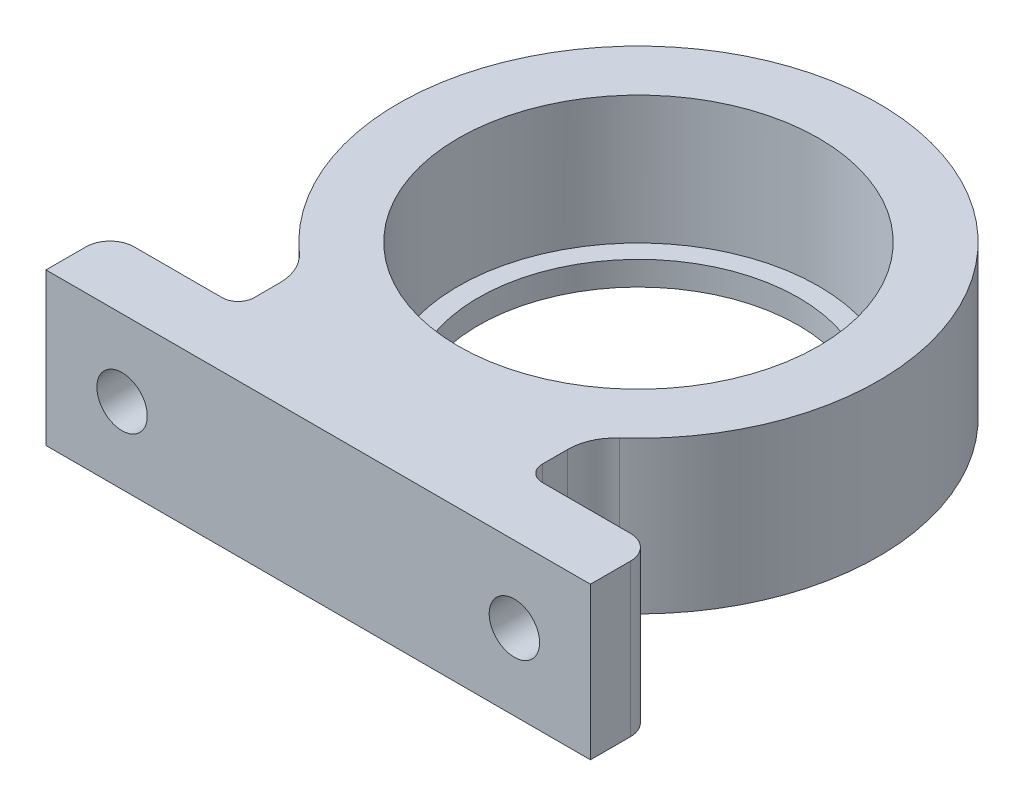
ISO-10303-21;
HEADER;
FILE_DESCRIPTION(('STEP AP214'),'2;1');
FILE_NAME('part.step','',(''),(''),'','','');
FILE_SCHEMA(('AUTOMOTIVE_DESIGN { 1 0 10303 214 1 1 1 1 }'));
ENDSEC;
DATA;
#1=APPLICATION_CONTEXT('core data for automotive mechanical design processes');
#2=APPLICATION_PROTOCOL_DEFINITION('international standard','automotive_design',2000,#1);
#3=PRODUCT_CONTEXT('',#1,'mechanical');
#4=PRODUCT('Part','Part','',(#3));
#5=PRODUCT_RELATED_PRODUCT_CATEGORY('part','',(#4));
#6=PRODUCT_DEFINITION_FORMATION('','',#4);
#7=PRODUCT_DEFINITION_CONTEXT('part definition',#1,'design');
#8=PRODUCT_DEFINITION('design','',#6,#7);
#9=PRODUCT_DEFINITION_SHAPE('','',#8);
#10=(LENGTH_UNIT() NAMED_UNIT(*) SI_UNIT(.MILLI.,.METRE.));
#11=(NAMED_UNIT(*) PLANE_ANGLE_UNIT() SI_UNIT($,.RADIAN.));
#12=(NAMED_UNIT(*) SI_UNIT($,.STERADIAN.) SOLID_ANGLE_UNIT());
#13=UNCERTAINTY_MEASURE_WITH_UNIT(LENGTH_MEASURE(1.E-05),#10,'distance_accuracy_value','');
#14=(GEOMETRIC_REPRESENTATION_CONTEXT(3) GLOBAL_UNCERTAINTY_ASSIGNED_CONTEXT((#13)) GLOBAL_UNIT_ASSIGNED_CONTEXT((#10,
#11,#12)) REPRESENTATION_CONTEXT('',''));
#15=CARTESIAN_POINT('',(0.,0.,0.));
#16=DIRECTION('',(0.,0.,1.));
#17=DIRECTION('',(1.,0.,0.));
#18=AXIS2_PLACEMENT_3D('',#15,#16,#17);
#19=CARTESIAN_POINT('',(0.,9.5,-20.422205101856));
#20=DIRECTION('',(0.,-1.,0.));
#21=DIRECTION('',(0.,0.,-1.));
#22=AXIS2_PLACEMENT_3D('',#19,#20,#21);
#23=CYLINDRICAL_SURFACE('',#22,11.25);
#24=CARTESIAN_POINT('',(0.,9.5,-20.422205101856));
#25=DIRECTION('',(0.,1.,0.));
#26=DIRECTION('',(0.,0.,1.));
#27=AXIS2_PLACEMENT_3D('',#24,#25,#26);
#28=CIRCLE('',#27,11.25);
#29=CARTESIAN_POINT('',(0.,9.5,-9.17220510185595));
#30=VERTEX_POINT('',#29);
#31=EDGE_CURVE('E166',#30,#30,#28,.T.);
#32=ORIENTED_EDGE('',*,*,#31,.T.);
#33=EDGE_LOOP('',(#32));
#34=FACE_BOUND('',#33,.T.);
#35=CARTESIAN_POINT('',(0.,1.5,-20.422205101856));
#36=DIRECTION('',(0.,-1.,0.));
#37=DIRECTION('',(0.,0.,-1.));
#38=AXIS2_PLACEMENT_3D('',#35,#36,#37);
#39=CIRCLE('',#38,11.25);
#40=CARTESIAN_POINT('',(0.,1.5,-31.672205101856));
#41=VERTEX_POINT('',#40);
#42=EDGE_CURVE('E194',#41,#41,#39,.T.);
#43=ORIENTED_EDGE('',*,*,#42,.T.);
#44=EDGE_LOOP('',(#43));
#45=FACE_BOUND('',#44,.T.);
#46=ADVANCED_FACE('F37',(#34,#45),#23,.F.);
#47=CARTESIAN_POINT('',(0.,9.5,-4.42220510185595));
#48=DIRECTION('',(0.,0.,-1.));
#49=DIRECTION('',(-1.,0.,0.));
#50=AXIS2_PLACEMENT_3D('',#47,#48,#49);
#51=PLANE('',#50);
#52=CARTESIAN_POINT('',(-12.25,4.75,-4.42220510185595));
#53=DIRECTION('',(0.,0.,-1.));
#54=DIRECTION('',(-1.,0.,0.));
#55=AXIS2_PLACEMENT_3D('',#52,#53,#54);
#56=CIRCLE('',#55,1.575);
#57=CARTESIAN_POINT('',(-13.825,4.75,-4.42220510185595));
#58=VERTEX_POINT('',#57);
#59=EDGE_CURVE('E491',#58,#58,#56,.T.);
#60=ORIENTED_EDGE('',*,*,#59,.F.);
#61=EDGE_LOOP('',(#60));
#62=FACE_BOUND('',#61,.T.);
#63=DIRECTION('',(1.,0.,0.));
#64=VECTOR('',#63,1.);
#65=CARTESIAN_POINT('',(0.,9.5,-4.42220510185595));
#66=LINE('',#65,#64);
#67=CARTESIAN_POINT('',(-15.5,9.5,-4.42220510185595));
#68=VERTEX_POINT('',#67);
#69=CARTESIAN_POINT('',(-10.,9.5,-4.42220510185595));
#70=VERTEX_POINT('',#69);
#71=EDGE_CURVE('E144',#68,#70,#66,.T.);
#72=ORIENTED_EDGE('',*,*,#71,.T.);
#73=DIRECTION('',(0.,-1.,0.));
#74=VECTOR('',#73,1.);
#75=CARTESIAN_POINT('',(-10.,0.,-4.42220510185595));
#76=LINE('',#75,#74);
#77=CARTESIAN_POINT('',(-10.,0.,-4.42220510185595));
#78=VERTEX_POINT('',#77);
#79=EDGE_CURVE('E233',#70,#78,#76,.T.);
#80=ORIENTED_EDGE('',*,*,#79,.T.);
#81=DIRECTION('',(1.,0.,0.));
#82=VECTOR('',#81,1.);
#83=CARTESIAN_POINT('',(0.,0.,-4.42220510185595));
#84=LINE('',#83,#82);
#85=CARTESIAN_POINT('',(-15.5,0.,-4.42220510185595));
#86=VERTEX_POINT('',#85);
#87=EDGE_CURVE('E147',#86,#78,#84,.T.);
#88=ORIENTED_EDGE('',*,*,#87,.F.);
#89=DIRECTION('',(0.,-1.,0.));
#90=VECTOR('',#89,1.);
#91=CARTESIAN_POINT('',(-15.5,9.5,-4.42220510185595));
#92=LINE('',#91,#90);
#93=EDGE_CURVE('E139',#68,#86,#92,.T.);
#94=ORIENTED_EDGE('',*,*,#93,.F.);
#95=EDGE_LOOP('',(#72,#80,#88,#94));
#96=FACE_BOUND('',#95,.T.);
#97=ADVANCED_FACE('F141',(#62,#96),#51,.T.);
#98=CARTESIAN_POINT('',(-15.5,9.5,-2.92220510185595));
#99=DIRECTION('',(0.,-1.,0.));
#100=DIRECTION('',(0.,0.,-1.));
#101=AXIS2_PLACEMENT_3D('',#98,#99,#100);
#102=CYLINDRICAL_SURFACE('',#101,1.5);
#103=CARTESIAN_POINT('',(-15.5,0.,-2.92220510185595));
#104=DIRECTION('',(0.,1.,0.));
#105=DIRECTION('',(0.,0.,1.));
#106=AXIS2_PLACEMENT_3D('',#103,#104,#105);
#107=CIRCLE('',#106,1.5);
#108=CARTESIAN_POINT('',(-17.,0.,-2.92220510185595));
#109=VERTEX_POINT('',#108);
#110=EDGE_CURVE('E193',#86,#109,#107,.T.);
#111=ORIENTED_EDGE('',*,*,#110,.T.);
#112=DIRECTION('',(0.,-1.,0.));
#113=VECTOR('',#112,1.);
#114=CARTESIAN_POINT('',(-17.,9.5,-2.92220510185595));
#115=LINE('',#114,#113);
#116=CARTESIAN_POINT('',(-17.,9.5,-2.92220510185595));
#117=VERTEX_POINT('',#116);
#118=EDGE_CURVE('E152',#117,#109,#115,.T.);
#119=ORIENTED_EDGE('',*,*,#118,.F.);
#120=CARTESIAN_POINT('',(-15.5,9.5,-2.92220510185595));
#121=DIRECTION('',(0.,1.,0.));
#122=DIRECTION('',(0.,0.,1.));
#123=AXIS2_PLACEMENT_3D('',#120,#121,#122);
#124=CIRCLE('',#123,1.5);
#125=EDGE_CURVE('E156',#68,#117,#124,.T.);
#126=ORIENTED_EDGE('',*,*,#125,.F.);
#127=ORIENTED_EDGE('',*,*,#93,.T.);
#128=EDGE_LOOP('',(#111,#119,#126,#127));
#129=FACE_BOUND('',#128,.T.);
#130=ADVANCED_FACE('F157',(#129),#102,.T.);
#131=CARTESIAN_POINT('',(-17.,9.5,0.));
#132=DIRECTION('',(1.,0.,0.));
#133=DIRECTION('',(0.,0.,-1.));
#134=AXIS2_PLACEMENT_3D('',#131,#132,#133);
#135=PLANE('',#134);
#136=DIRECTION('',(0.,0.,1.));
#137=VECTOR('',#136,1.);
#138=CARTESIAN_POINT('',(-17.,0.,0.));
#139=LINE('',#138,#137);
#140=CARTESIAN_POINT('',(-17.,0.,-0.422205101855954));
#141=VERTEX_POINT('',#140);
#142=EDGE_CURVE('E196',#109,#141,#139,.T.);
#143=ORIENTED_EDGE('',*,*,#142,.T.);
#144=DIRECTION('',(0.,-1.,0.));
#145=VECTOR('',#144,1.);
#146=CARTESIAN_POINT('',(-17.,9.5,-0.422205101855954));
#147=LINE('',#146,#145);
#148=CARTESIAN_POINT('',(-17.,9.5,-0.422205101855954));
#149=VERTEX_POINT('',#148);
#150=EDGE_CURVE('E223',#149,#141,#147,.T.);
#151=ORIENTED_EDGE('',*,*,#150,.F.);
#152=DIRECTION('',(0.,0.,1.));
#153=VECTOR('',#152,1.);
#154=CARTESIAN_POINT('',(-17.,9.5,0.));
#155=LINE('',#154,#153);
#156=EDGE_CURVE('E160',#117,#149,#155,.T.);
#157=ORIENTED_EDGE('',*,*,#156,.F.);
#158=ORIENTED_EDGE('',*,*,#118,.T.);
#159=EDGE_LOOP('',(#143,#151,#157,#158));
#160=FACE_BOUND('',#159,.T.);
#161=ADVANCED_FACE('F270',(#160),#135,.F.);
#162=CARTESIAN_POINT('',(0.,9.5,-0.422205101855954));
#163=DIRECTION('',(0.,0.,-1.));
#164=DIRECTION('',(-1.,0.,0.));
#165=AXIS2_PLACEMENT_3D('',#162,#163,#164);
#166=PLANE('',#165);
#167=CARTESIAN_POINT('',(12.25,4.75,-0.422205101855949));
#168=DIRECTION('',(0.,0.,-1.));
#169=DIRECTION('',(-1.,0.,0.));
#170=AXIS2_PLACEMENT_3D('',#167,#168,#169);
#171=CIRCLE('',#170,1.575);
#172=CARTESIAN_POINT('',(10.675,4.75,-0.422205101855949));
#173=VERTEX_POINT('',#172);
#174=EDGE_CURVE('E486',#173,#173,#171,.T.);
#175=ORIENTED_EDGE('',*,*,#174,.T.);
#176=EDGE_LOOP('',(#175));
#177=FACE_BOUND('',#176,.T.);
#178=CARTESIAN_POINT('',(-12.25,4.75,-0.422205101855949));
#179=DIRECTION('',(0.,0.,-1.));
#180=DIRECTION('',(-1.,0.,0.));
#181=AXIS2_PLACEMENT_3D('',#178,#179,#180);
#182=CIRCLE('',#181,1.575);
#183=CARTESIAN_POINT('',(-13.825,4.75,-0.422205101855949));
#184=VERTEX_POINT('',#183);
#185=EDGE_CURVE('E489',#184,#184,#182,.T.);
#186=ORIENTED_EDGE('',*,*,#185,.T.);
#187=EDGE_LOOP('',(#186));
#188=FACE_BOUND('',#187,.T.);
#189=DIRECTION('',(1.,0.,0.));
#190=VECTOR('',#189,1.);
#191=CARTESIAN_POINT('',(0.,0.,-0.422205101855954));
#192=LINE('',#191,#190);
#193=CARTESIAN_POINT('',(17.,0.,-0.422205101855954));
#194=VERTEX_POINT('',#193);
#195=EDGE_CURVE('E199',#141,#194,#192,.T.);
#196=ORIENTED_EDGE('',*,*,#195,.T.);
#197=DIRECTION('',(0.,-1.,0.));
#198=VECTOR('',#197,1.);
#199=CARTESIAN_POINT('',(17.,9.5,-0.422205101855954));
#200=LINE('',#199,#198);
#201=CARTESIAN_POINT('',(17.,9.5,-0.422205101855954));
#202=VERTEX_POINT('',#201);
#203=EDGE_CURVE('E221',#202,#194,#200,.T.);
#204=ORIENTED_EDGE('',*,*,#203,.F.);
#205=DIRECTION('',(1.,0.,0.));
#206=VECTOR('',#205,1.);
#207=CARTESIAN_POINT('',(0.,9.5,-0.422205101855954));
#208=LINE('',#207,#206);
#209=EDGE_CURVE('E174',#149,#202,#208,.T.);
#210=ORIENTED_EDGE('',*,*,#209,.F.);
#211=ORIENTED_EDGE('',*,*,#150,.T.);
#212=EDGE_LOOP('',(#196,#204,#210,#211));
#213=FACE_BOUND('',#212,.T.);
#214=ADVANCED_FACE('F275',(#177,#188,#213),#166,.F.);
#215=CARTESIAN_POINT('',(17.,9.5,0.));
#216=DIRECTION('',(1.,0.,0.));
#217=DIRECTION('',(0.,0.,-1.));
#218=AXIS2_PLACEMENT_3D('',#215,#216,#217);
#219=PLANE('',#218);
#220=DIRECTION('',(0.,0.,1.));
#221=VECTOR('',#220,1.);
#222=CARTESIAN_POINT('',(17.,0.,0.));
#223=LINE('',#222,#221);
#224=CARTESIAN_POINT('',(17.,0.,-2.92220510185595));
#225=VERTEX_POINT('',#224);
#226=EDGE_CURVE('E202',#225,#194,#223,.T.);
#227=ORIENTED_EDGE('',*,*,#226,.F.);
#228=DIRECTION('',(0.,-1.,0.));
#229=VECTOR('',#228,1.);
#230=CARTESIAN_POINT('',(17.,9.5,-2.92220510185595));
#231=LINE('',#230,#229);
#232=CARTESIAN_POINT('',(17.,9.5,-2.92220510185595));
#233=VERTEX_POINT('',#232);
#234=EDGE_CURVE('E219',#233,#225,#231,.T.);
#235=ORIENTED_EDGE('',*,*,#234,.F.);
#236=DIRECTION('',(0.,0.,1.));
#237=VECTOR('',#236,1.);
#238=CARTESIAN_POINT('',(17.,9.5,0.));
#239=LINE('',#238,#237);
#240=EDGE_CURVE('E176',#233,#202,#239,.T.);
#241=ORIENTED_EDGE('',*,*,#240,.T.);
#242=ORIENTED_EDGE('',*,*,#203,.T.);
#243=EDGE_LOOP('',(#227,#235,#241,#242));
#244=FACE_BOUND('',#243,.T.);
#245=ADVANCED_FACE('F278',(#244),#219,.T.);
#246=CARTESIAN_POINT('',(15.5,9.5,-2.92220510185595));
#247=DIRECTION('',(0.,-1.,0.));
#248=DIRECTION('',(0.,0.,-1.));
#249=AXIS2_PLACEMENT_3D('',#246,#247,#248);
#250=CYLINDRICAL_SURFACE('',#249,1.5);
#251=CARTESIAN_POINT('',(15.5,0.,-2.92220510185595));
#252=DIRECTION('',(0.,1.,0.));
#253=DIRECTION('',(0.,0.,1.));
#254=AXIS2_PLACEMENT_3D('',#251,#252,#253);
#255=CIRCLE('',#254,1.5);
#256=CARTESIAN_POINT('',(15.5,0.,-4.42220510185595));
#257=VERTEX_POINT('',#256);
#258=EDGE_CURVE('E205',#257,#225,#255,.F.);
#259=ORIENTED_EDGE('',*,*,#258,.F.);
#260=DIRECTION('',(0.,-1.,0.));
#261=VECTOR('',#260,1.);
#262=CARTESIAN_POINT('',(15.5,9.5,-4.42220510185595));
#263=LINE('',#262,#261);
#264=CARTESIAN_POINT('',(15.5,9.5,-4.42220510185595));
#265=VERTEX_POINT('',#264);
#266=EDGE_CURVE('E191',#265,#257,#263,.T.);
#267=ORIENTED_EDGE('',*,*,#266,.F.);
#268=CARTESIAN_POINT('',(15.5,9.5,-2.92220510185595));
#269=DIRECTION('',(0.,1.,0.));
#270=DIRECTION('',(0.,0.,1.));
#271=AXIS2_PLACEMENT_3D('',#268,#269,#270);
#272=CIRCLE('',#271,1.5);
#273=EDGE_CURVE('E179',#265,#233,#272,.F.);
#274=ORIENTED_EDGE('',*,*,#273,.T.);
#275=ORIENTED_EDGE('',*,*,#234,.T.);
#276=EDGE_LOOP('',(#259,#267,#274,#275));
#277=FACE_BOUND('',#276,.T.);
#278=ADVANCED_FACE('F281',(#277),#250,.T.);
#279=CARTESIAN_POINT('',(0.,9.5,-4.42220510185595));
#280=DIRECTION('',(0.,0.,-1.));
#281=DIRECTION('',(-1.,0.,0.));
#282=AXIS2_PLACEMENT_3D('',#279,#280,#281);
#283=PLANE('',#282);
#284=CARTESIAN_POINT('',(12.25,4.75,-4.42220510185595));
#285=DIRECTION('',(0.,0.,-1.));
#286=DIRECTION('',(-1.,0.,0.));
#287=AXIS2_PLACEMENT_3D('',#284,#285,#286);
#288=CIRCLE('',#287,1.575);
#289=CARTESIAN_POINT('',(10.675,4.75,-4.42220510185595));
#290=VERTEX_POINT('',#289);
#291=EDGE_CURVE('E499',#290,#290,#288,.T.);
#292=ORIENTED_EDGE('',*,*,#291,.F.);
#293=EDGE_LOOP('',(#292));
#294=FACE_BOUND('',#293,.T.);
#295=DIRECTION('',(1.,0.,0.));
#296=VECTOR('',#295,1.);
#297=CARTESIAN_POINT('',(0.,0.,-4.42220510185595));
#298=LINE('',#297,#296);
#299=CARTESIAN_POINT('',(9.99999999999999,0.,-4.42220510185595));
#300=VERTEX_POINT('',#299);
#301=EDGE_CURVE('E208',#300,#257,#298,.T.);
#302=ORIENTED_EDGE('',*,*,#301,.F.);
#303=DIRECTION('',(0.,-1.,0.));
#304=VECTOR('',#303,1.);
#305=CARTESIAN_POINT('',(9.99999999999999,9.5,-4.42220510185595));
#306=LINE('',#305,#304);
#307=CARTESIAN_POINT('',(9.99999999999999,9.5,-4.42220510185595));
#308=VERTEX_POINT('',#307);
#309=EDGE_CURVE('E231',#300,#308,#306,.F.);
#310=ORIENTED_EDGE('',*,*,#309,.T.);
#311=DIRECTION('',(1.,0.,0.));
#312=VECTOR('',#311,1.);
#313=CARTESIAN_POINT('',(0.,9.5,-4.42220510185595));
#314=LINE('',#313,#312);
#315=EDGE_CURVE('E182',#308,#265,#314,.T.);
#316=ORIENTED_EDGE('',*,*,#315,.T.);
#317=ORIENTED_EDGE('',*,*,#266,.T.);
#318=EDGE_LOOP('',(#302,#310,#316,#317));
#319=FACE_BOUND('',#318,.T.);
#320=ADVANCED_FACE('F350',(#294,#319),#283,.T.);
#321=CARTESIAN_POINT('',(8.99999999999999,9.5,0.));
#322=DIRECTION('',(-1.,0.,0.));
#323=DIRECTION('',(0.,0.,1.));
#324=AXIS2_PLACEMENT_3D('',#321,#322,#323);
#325=PLANE('',#324);
#326=DIRECTION('',(0.,0.,-1.));
#327=VECTOR('',#326,1.);
#328=CARTESIAN_POINT('',(8.99999999999999,9.5,0.));
#329=LINE('',#328,#327);
#330=CARTESIAN_POINT('',(8.99999999999999,9.5,-5.42220510185595));
#331=VERTEX_POINT('',#330);
#332=CARTESIAN_POINT('',(8.99999999999999,9.5,-7.00579723685721));
#333=VERTEX_POINT('',#332);
#334=EDGE_CURVE('E184',#331,#333,#329,.T.);
#335=ORIENTED_EDGE('',*,*,#334,.F.);
#336=DIRECTION('',(0.,-1.,0.));
#337=VECTOR('',#336,1.);
#338=CARTESIAN_POINT('',(8.99999999999999,9.5,-5.42220510185595));
#339=LINE('',#338,#337);
#340=CARTESIAN_POINT('',(8.99999999999999,0.,-5.42220510185595));
#341=VERTEX_POINT('',#340);
#342=EDGE_CURVE('E228',#331,#341,#339,.T.);
#343=ORIENTED_EDGE('',*,*,#342,.T.);
#344=DIRECTION('',(0.,0.,-1.));
#345=VECTOR('',#344,1.);
#346=CARTESIAN_POINT('',(8.99999999999999,0.,0.));
#347=LINE('',#346,#345);
#348=CARTESIAN_POINT('',(8.99999999999999,0.,-7.00579723685721));
#349=VERTEX_POINT('',#348);
#350=EDGE_CURVE('E210',#341,#349,#347,.T.);
#351=ORIENTED_EDGE('',*,*,#350,.T.);
#352=DIRECTION('',(0.,1.,0.));
#353=VECTOR('',#352,1.);
#354=CARTESIAN_POINT('',(8.99999999999999,9.5,-7.00579723685721));
#355=LINE('',#354,#353);
#356=EDGE_CURVE('E151',#349,#333,#355,.T.);
#357=ORIENTED_EDGE('',*,*,#356,.T.);
#358=EDGE_LOOP('',(#335,#343,#351,#357));
#359=FACE_BOUND('',#358,.T.);
#360=ADVANCED_FACE('F293',(#359),#325,.F.);
#361=CARTESIAN_POINT('',(0.,9.5,-20.422205101856));
#362=DIRECTION('',(0.,-1.,0.));
#363=DIRECTION('',(0.,0.,-1.));
#364=AXIS2_PLACEMENT_3D('',#361,#362,#363);
#365=CYLINDRICAL_SURFACE('',#364,15.);
#366=CARTESIAN_POINT('',(0.,9.5,-20.422205101856));
#367=DIRECTION('',(0.,1.,0.));
#368=DIRECTION('',(0.,0.,1.));
#369=AXIS2_PLACEMENT_3D('',#366,#367,#368);
#370=CIRCLE('',#369,15.);
#371=CARTESIAN_POINT('',(9.99999999999999,9.5,-9.241865214357));
#372=VERTEX_POINT('',#371);
#373=CARTESIAN_POINT('',(-10.,9.5,-9.241865214357));
#374=VERTEX_POINT('',#373);
#375=EDGE_CURVE('E186',#372,#374,#370,.T.);
#376=ORIENTED_EDGE('',*,*,#375,.F.);
#377=DIRECTION('',(0.,-1.,0.));
#378=VECTOR('',#377,1.);
#379=CARTESIAN_POINT('',(9.99999999999999,9.5,-9.241865214357));
#380=LINE('',#379,#378);
#381=CARTESIAN_POINT('',(9.99999999999999,0.,-9.241865214357));
#382=VERTEX_POINT('',#381);
#383=EDGE_CURVE('E241',#372,#382,#380,.T.);
#384=ORIENTED_EDGE('',*,*,#383,.T.);
#385=CARTESIAN_POINT('',(0.,0.,-20.422205101856));
#386=DIRECTION('',(0.,1.,0.));
#387=DIRECTION('',(0.,0.,1.));
#388=AXIS2_PLACEMENT_3D('',#385,#386,#387);
#389=CIRCLE('',#388,15.);
#390=CARTESIAN_POINT('',(-10.,0.,-9.241865214357));
#391=VERTEX_POINT('',#390);
#392=EDGE_CURVE('E213',#382,#391,#389,.T.);
#393=ORIENTED_EDGE('',*,*,#392,.T.);
#394=DIRECTION('',(0.,-1.,0.));
#395=VECTOR('',#394,1.);
#396=CARTESIAN_POINT('',(-10.,9.5,-9.241865214357));
#397=LINE('',#396,#395);
#398=EDGE_CURVE('E52',#391,#374,#397,.F.);
#399=ORIENTED_EDGE('',*,*,#398,.T.);
#400=EDGE_LOOP('',(#376,#384,#393,#399));
#401=FACE_BOUND('',#400,.T.);
#402=ADVANCED_FACE('F260',(#401),#365,.T.);
#403=CARTESIAN_POINT('',(-9.,9.5,0.));
#404=DIRECTION('',(-1.,0.,0.));
#405=DIRECTION('',(0.,0.,1.));
#406=AXIS2_PLACEMENT_3D('',#403,#404,#405);
#407=PLANE('',#406);
#408=DIRECTION('',(0.,0.,-1.));
#409=VECTOR('',#408,1.);
#410=CARTESIAN_POINT('',(-9.,0.,0.));
#411=LINE('',#410,#409);
#412=CARTESIAN_POINT('',(-9.,0.,-5.42220510185595));
#413=VERTEX_POINT('',#412);
#414=CARTESIAN_POINT('',(-9.,0.,-7.00579723685721));
#415=VERTEX_POINT('',#414);
#416=EDGE_CURVE('E169',#413,#415,#411,.T.);
#417=ORIENTED_EDGE('',*,*,#416,.F.);
#418=DIRECTION('',(0.,-1.,0.));
#419=VECTOR('',#418,1.);
#420=CARTESIAN_POINT('',(-9.,9.5,-5.42220510185595));
#421=LINE('',#420,#419);
#422=CARTESIAN_POINT('',(-9.,9.5,-5.42220510185595));
#423=VERTEX_POINT('',#422);
#424=EDGE_CURVE('E238',#413,#423,#421,.F.);
#425=ORIENTED_EDGE('',*,*,#424,.T.);
#426=DIRECTION('',(0.,0.,-1.));
#427=VECTOR('',#426,1.);
#428=CARTESIAN_POINT('',(-9.,9.5,0.));
#429=LINE('',#428,#427);
#430=CARTESIAN_POINT('',(-9.,9.5,-7.00579723685721));
#431=VERTEX_POINT('',#430);
#432=EDGE_CURVE('E188',#423,#431,#429,.T.);
#433=ORIENTED_EDGE('',*,*,#432,.T.);
#434=DIRECTION('',(0.,-1.,0.));
#435=VECTOR('',#434,1.);
#436=CARTESIAN_POINT('',(-9.,9.5,-7.00579723685721));
#437=LINE('',#436,#435);
#438=EDGE_CURVE('E235',#431,#415,#437,.T.);
#439=ORIENTED_EDGE('',*,*,#438,.T.);
#440=EDGE_LOOP('',(#417,#425,#433,#439));
#441=FACE_BOUND('',#440,.T.);
#442=ADVANCED_FACE('F264',(#441),#407,.T.);
#443=CARTESIAN_POINT('',(0.,9.5,0.));
#444=DIRECTION('',(0.,1.,0.));
#445=DIRECTION('',(0.,0.,1.));
#446=AXIS2_PLACEMENT_3D('',#443,#444,#445);
#447=PLANE('',#446);
#448=ORIENTED_EDGE('',*,*,#31,.F.);
#449=EDGE_LOOP('',(#448));
#450=FACE_BOUND('',#449,.T.);
#451=ORIENTED_EDGE('',*,*,#71,.F.);
#452=ORIENTED_EDGE('',*,*,#125,.T.);
#453=ORIENTED_EDGE('',*,*,#156,.T.);
#454=ORIENTED_EDGE('',*,*,#209,.T.);
#455=ORIENTED_EDGE('',*,*,#240,.F.);
#456=ORIENTED_EDGE('',*,*,#273,.F.);
#457=ORIENTED_EDGE('',*,*,#315,.F.);
#458=CARTESIAN_POINT('',(9.99999999999999,9.5,-5.42220510185595));
#459=DIRECTION('',(0.,1.,0.));
#460=DIRECTION('',(0.,0.,1.));
#461=AXIS2_PLACEMENT_3D('',#458,#459,#460);
#462=CIRCLE('',#461,1.);
#463=EDGE_CURVE('E246',#308,#331,#462,.F.);
#464=ORIENTED_EDGE('',*,*,#463,.T.);
#465=ORIENTED_EDGE('',*,*,#334,.T.);
#466=CARTESIAN_POINT('',(12.,9.5,-7.00579723685721));
#467=DIRECTION('',(0.,1.,0.));
#468=DIRECTION('',(0.,0.,1.));
#469=AXIS2_PLACEMENT_3D('',#466,#467,#468);
#470=CIRCLE('',#469,3.);
#471=EDGE_CURVE('E59',#333,#372,#470,.F.);
#472=ORIENTED_EDGE('',*,*,#471,.T.);
#473=ORIENTED_EDGE('',*,*,#375,.T.);
#474=CARTESIAN_POINT('',(-12.,9.5,-7.00579723685721));
#475=DIRECTION('',(0.,1.,0.));
#476=DIRECTION('',(0.,0.,1.));
#477=AXIS2_PLACEMENT_3D('',#474,#475,#476);
#478=CIRCLE('',#477,3.);
#479=EDGE_CURVE('E12',#374,#431,#478,.F.);
#480=ORIENTED_EDGE('',*,*,#479,.T.);
#481=ORIENTED_EDGE('',*,*,#432,.F.);
#482=CARTESIAN_POINT('',(-10.,9.5,-5.42220510185595));
#483=DIRECTION('',(0.,1.,0.));
#484=DIRECTION('',(0.,0.,1.));
#485=AXIS2_PLACEMENT_3D('',#482,#483,#484);
#486=CIRCLE('',#485,1.);
#487=EDGE_CURVE('E165',#423,#70,#486,.F.);
#488=ORIENTED_EDGE('',*,*,#487,.T.);
#489=EDGE_LOOP('',(#451,#452,#453,#454,#455,#456,#457,#464,#465,#472,#473,#480,#481,#488));
#490=FACE_BOUND('',#489,.T.);
#491=ADVANCED_FACE('F162',(#450,#490),#447,.T.);
#492=CARTESIAN_POINT('',(0.,0.,0.));
#493=DIRECTION('',(0.,1.,0.));
#494=DIRECTION('',(0.,0.,1.));
#495=AXIS2_PLACEMENT_3D('',#492,#493,#494);
#496=PLANE('',#495);
#497=ORIENTED_EDGE('',*,*,#87,.T.);
#498=CARTESIAN_POINT('',(-10.,0.,-5.42220510185595));
#499=DIRECTION('',(0.,1.,0.));
#500=DIRECTION('',(0.,0.,1.));
#501=AXIS2_PLACEMENT_3D('',#498,#499,#500);
#502=CIRCLE('',#501,1.);
#503=EDGE_CURVE('E248',#78,#413,#502,.T.);
#504=ORIENTED_EDGE('',*,*,#503,.T.);
#505=ORIENTED_EDGE('',*,*,#416,.T.);
#506=CARTESIAN_POINT('',(-12.,0.,-7.00579723685721));
#507=DIRECTION('',(0.,1.,0.));
#508=DIRECTION('',(0.,0.,1.));
#509=AXIS2_PLACEMENT_3D('',#506,#507,#508);
#510=CIRCLE('',#509,3.);
#511=EDGE_CURVE('E45',#415,#391,#510,.T.);
#512=ORIENTED_EDGE('',*,*,#511,.T.);
#513=ORIENTED_EDGE('',*,*,#392,.F.);
#514=CARTESIAN_POINT('',(12.,0.,-7.00579723685721));
#515=DIRECTION('',(0.,1.,0.));
#516=DIRECTION('',(0.,0.,1.));
#517=AXIS2_PLACEMENT_3D('',#514,#515,#516);
#518=CIRCLE('',#517,3.);
#519=EDGE_CURVE('E251',#382,#349,#518,.T.);
#520=ORIENTED_EDGE('',*,*,#519,.T.);
#521=ORIENTED_EDGE('',*,*,#350,.F.);
#522=CARTESIAN_POINT('',(9.99999999999999,0.,-5.42220510185595));
#523=DIRECTION('',(0.,1.,0.));
#524=DIRECTION('',(0.,0.,1.));
#525=AXIS2_PLACEMENT_3D('',#522,#523,#524);
#526=CIRCLE('',#525,1.);
#527=EDGE_CURVE('E244',#341,#300,#526,.T.);
#528=ORIENTED_EDGE('',*,*,#527,.T.);
#529=ORIENTED_EDGE('',*,*,#301,.T.);
#530=ORIENTED_EDGE('',*,*,#258,.T.);
#531=ORIENTED_EDGE('',*,*,#226,.T.);
#532=ORIENTED_EDGE('',*,*,#195,.F.);
#533=ORIENTED_EDGE('',*,*,#142,.F.);
#534=ORIENTED_EDGE('',*,*,#110,.F.);
#535=EDGE_LOOP('',(#497,#504,#505,#512,#513,#520,#521,#528,#529,#530,#531,#532,#533,#534));
#536=FACE_BOUND('',#535,.T.);
#537=CARTESIAN_POINT('',(0.,0.,-20.422205101856));
#538=DIRECTION('',(0.,-1.,0.));
#539=DIRECTION('',(0.,0.,-1.));
#540=AXIS2_PLACEMENT_3D('',#537,#538,#539);
#541=CIRCLE('',#540,10.);
#542=CARTESIAN_POINT('',(0.,0.,-30.422205101856));
#543=VERTEX_POINT('',#542);
#544=EDGE_CURVE('E490',#543,#543,#541,.T.);
#545=ORIENTED_EDGE('',*,*,#544,.F.);
#546=EDGE_LOOP('',(#545));
#547=FACE_BOUND('',#546,.T.);
#548=ADVANCED_FACE('F255',(#536,#547),#496,.F.);
#549=CARTESIAN_POINT('',(0.,1.5,-20.422205101856));
#550=DIRECTION('',(0.,-1.,0.));
#551=DIRECTION('',(0.,0.,-1.));
#552=AXIS2_PLACEMENT_3D('',#549,#550,#551);
#553=PLANE('',#552);
#554=CARTESIAN_POINT('',(0.,1.5,-20.422205101856));
#555=DIRECTION('',(0.,-1.,0.));
#556=DIRECTION('',(0.,0.,-1.));
#557=AXIS2_PLACEMENT_3D('',#554,#555,#556);
#558=CIRCLE('',#557,10.);
#559=CARTESIAN_POINT('',(0.,1.5,-30.422205101856));
#560=VERTEX_POINT('',#559);
#561=EDGE_CURVE('E494',#560,#560,#558,.T.);
#562=ORIENTED_EDGE('',*,*,#561,.T.);
#563=EDGE_LOOP('',(#562));
#564=FACE_BOUND('',#563,.T.);
#565=ORIENTED_EDGE('',*,*,#42,.F.);
#566=EDGE_LOOP('',(#565));
#567=FACE_BOUND('',#566,.T.);
#568=ADVANCED_FACE('F334',(#564,#567),#553,.F.);
#569=CARTESIAN_POINT('',(0.,1.5,-20.422205101856));
#570=DIRECTION('',(0.,-1.,0.));
#571=DIRECTION('',(0.,0.,-1.));
#572=AXIS2_PLACEMENT_3D('',#569,#570,#571);
#573=CYLINDRICAL_SURFACE('',#572,10.);
#574=ORIENTED_EDGE('',*,*,#561,.F.);
#575=EDGE_LOOP('',(#574));
#576=FACE_BOUND('',#575,.T.);
#577=ORIENTED_EDGE('',*,*,#544,.T.);
#578=EDGE_LOOP('',(#577));
#579=FACE_BOUND('',#578,.T.);
#580=ADVANCED_FACE('F326',(#576,#579),#573,.F.);
#581=CARTESIAN_POINT('',(-12.25,4.75,-0.422205101855949));
#582=DIRECTION('',(0.,0.,-1.));
#583=DIRECTION('',(-1.,0.,0.));
#584=AXIS2_PLACEMENT_3D('',#581,#582,#583);
#585=CYLINDRICAL_SURFACE('',#584,1.575);
#586=ORIENTED_EDGE('',*,*,#185,.F.);
#587=EDGE_LOOP('',(#586));
#588=FACE_BOUND('',#587,.T.);
#589=ORIENTED_EDGE('',*,*,#59,.T.);
#590=EDGE_LOOP('',(#589));
#591=FACE_BOUND('',#590,.T.);
#592=ADVANCED_FACE('F320',(#588,#591),#585,.F.);
#593=CARTESIAN_POINT('',(12.25,4.75,-0.422205101855949));
#594=DIRECTION('',(0.,0.,-1.));
#595=DIRECTION('',(-1.,0.,0.));
#596=AXIS2_PLACEMENT_3D('',#593,#594,#595);
#597=CYLINDRICAL_SURFACE('',#596,1.575);
#598=ORIENTED_EDGE('',*,*,#174,.F.);
#599=EDGE_LOOP('',(#598));
#600=FACE_BOUND('',#599,.T.);
#601=ORIENTED_EDGE('',*,*,#291,.T.);
#602=EDGE_LOOP('',(#601));
#603=FACE_BOUND('',#602,.T.);
#604=ADVANCED_FACE('F316',(#600,#603),#597,.F.);
#605=CARTESIAN_POINT('',(9.99999999999999,9.5,-5.42220510185595));
#606=DIRECTION('',(0.,-1.,0.));
#607=DIRECTION('',(0.,0.,-1.));
#608=AXIS2_PLACEMENT_3D('',#605,#606,#607);
#609=CYLINDRICAL_SURFACE('',#608,1.);
#610=ORIENTED_EDGE('',*,*,#463,.F.);
#611=ORIENTED_EDGE('',*,*,#309,.F.);
#612=ORIENTED_EDGE('',*,*,#527,.F.);
#613=ORIENTED_EDGE('',*,*,#342,.F.);
#614=EDGE_LOOP('',(#610,#611,#612,#613));
#615=FACE_BOUND('',#614,.T.);
#616=ADVANCED_FACE('F290',(#615),#609,.F.);
#617=CARTESIAN_POINT('',(-10.,9.5,-5.42220510185595));
#618=DIRECTION('',(0.,1.,0.));
#619=DIRECTION('',(0.,0.,1.));
#620=AXIS2_PLACEMENT_3D('',#617,#618,#619);
#621=CYLINDRICAL_SURFACE('',#620,1.);
#622=ORIENTED_EDGE('',*,*,#487,.F.);
#623=ORIENTED_EDGE('',*,*,#424,.F.);
#624=ORIENTED_EDGE('',*,*,#503,.F.);
#625=ORIENTED_EDGE('',*,*,#79,.F.);
#626=EDGE_LOOP('',(#622,#623,#624,#625));
#627=FACE_BOUND('',#626,.T.);
#628=ADVANCED_FACE('F267',(#627),#621,.F.);
#629=CARTESIAN_POINT('',(12.,9.5,-7.00579723685721));
#630=DIRECTION('',(0.,-1.,0.));
#631=DIRECTION('',(0.,0.,-1.));
#632=AXIS2_PLACEMENT_3D('',#629,#630,#631);
#633=CYLINDRICAL_SURFACE('',#632,3.);
#634=ORIENTED_EDGE('',*,*,#471,.F.);
#635=ORIENTED_EDGE('',*,*,#356,.F.);
#636=ORIENTED_EDGE('',*,*,#519,.F.);
#637=ORIENTED_EDGE('',*,*,#383,.F.);
#638=EDGE_LOOP('',(#634,#635,#636,#637));
#639=FACE_BOUND('',#638,.T.);
#640=ADVANCED_FACE('F297',(#639),#633,.F.);
#641=CARTESIAN_POINT('',(-12.,9.5,-7.00579723685721));
#642=DIRECTION('',(0.,-1.,0.));
#643=DIRECTION('',(0.,0.,-1.));
#644=AXIS2_PLACEMENT_3D('',#641,#642,#643);
#645=CYLINDRICAL_SURFACE('',#644,3.);
#646=ORIENTED_EDGE('',*,*,#479,.F.);
#647=ORIENTED_EDGE('',*,*,#398,.F.);
#648=ORIENTED_EDGE('',*,*,#511,.F.);
#649=ORIENTED_EDGE('',*,*,#438,.F.);
#650=EDGE_LOOP('',(#646,#647,#648,#649));
#651=FACE_BOUND('',#650,.T.);
#652=ADVANCED_FACE('F39',(#651),#645,.F.);
#653=CLOSED_SHELL('',(#46,#97,#130,#161,#214,#245,#278,#320,#360,#402,#442,#491,#548,#568,#580,
#592,#604,#616,#628,#640,#652));
#654=MANIFOLD_SOLID_BREP('B2',#653);
#655=ADVANCED_BREP_SHAPE_REPRESENTATION('',(#18,#654),#14);
#656=SHAPE_DEFINITION_REPRESENTATION(#9,#655);
ENDSEC;
END-ISO-10303-21;
